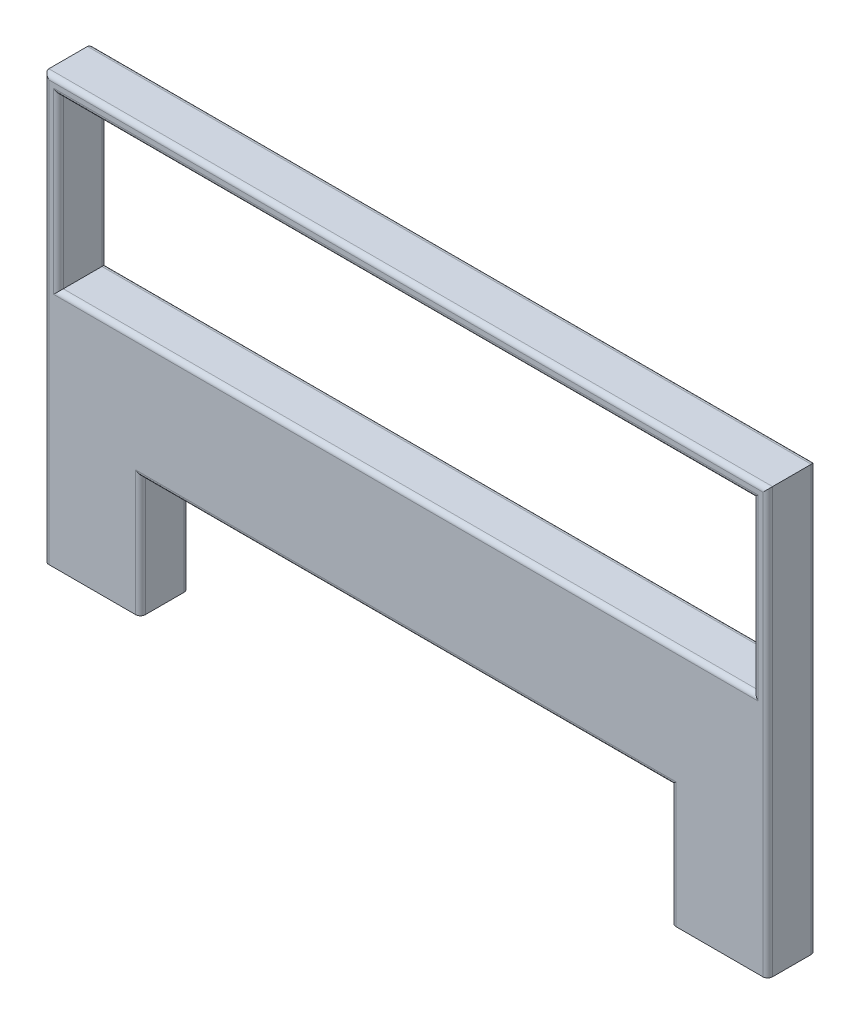
ISO-10303-21;
HEADER;
FILE_DESCRIPTION(('STEP AP214'),'2;1');
FILE_NAME('part.step','',(''),(''),'','','');
FILE_SCHEMA(('AUTOMOTIVE_DESIGN { 1 0 10303 214 1 1 1 1 }'));
ENDSEC;
DATA;
#1=APPLICATION_CONTEXT('core data for automotive mechanical design processes');
#2=APPLICATION_PROTOCOL_DEFINITION('international standard','automotive_design',2000,#1);
#3=PRODUCT_CONTEXT('',#1,'mechanical');
#4=PRODUCT('Part','Part','',(#3));
#5=PRODUCT_RELATED_PRODUCT_CATEGORY('part','',(#4));
#6=PRODUCT_DEFINITION_FORMATION('','',#4);
#7=PRODUCT_DEFINITION_CONTEXT('part definition',#1,'design');
#8=PRODUCT_DEFINITION('design','',#6,#7);
#9=PRODUCT_DEFINITION_SHAPE('','',#8);
#10=(LENGTH_UNIT() NAMED_UNIT(*) SI_UNIT(.MILLI.,.METRE.));
#11=(NAMED_UNIT(*) PLANE_ANGLE_UNIT() SI_UNIT($,.RADIAN.));
#12=(NAMED_UNIT(*) SI_UNIT($,.STERADIAN.) SOLID_ANGLE_UNIT());
#13=UNCERTAINTY_MEASURE_WITH_UNIT(LENGTH_MEASURE(1.E-05),#10,'distance_accuracy_value','');
#14=(GEOMETRIC_REPRESENTATION_CONTEXT(3) GLOBAL_UNCERTAINTY_ASSIGNED_CONTEXT((#13)) GLOBAL_UNIT_ASSIGNED_CONTEXT((#10,
#11,#12)) REPRESENTATION_CONTEXT('',''));
#15=CARTESIAN_POINT('',(0.,0.,0.));
#16=DIRECTION('',(0.,0.,1.));
#17=DIRECTION('',(1.,0.,0.));
#18=AXIS2_PLACEMENT_3D('',#15,#16,#17);
#19=CARTESIAN_POINT('',(0.,0.,100.));
#20=DIRECTION('',(0.,0.,-1.));
#21=DIRECTION('',(-1.,0.,0.));
#22=AXIS2_PLACEMENT_3D('',#19,#20,#21);
#23=PLANE('',#22);
#24=DIRECTION('',(0.,-1.,0.));
#25=VECTOR('',#24,1.);
#26=CARTESIAN_POINT('',(-850.336119727066,350.,100.));
#27=LINE('',#26,#25);
#28=CARTESIAN_POINT('',(-850.336119727066,-10.,100.));
#29=VERTEX_POINT('',#28);
#30=CARTESIAN_POINT('',(-850.336119727066,360.,100.));
#31=VERTEX_POINT('',#30);
#32=EDGE_CURVE('E381',#29,#31,#27,.F.);
#33=ORIENTED_EDGE('',*,*,#32,.T.);
#34=DIRECTION('',(-1.,0.,0.));
#35=VECTOR('',#34,1.);
#36=CARTESIAN_POINT('',(599.663880272934,360.,100.));
#37=LINE('',#36,#35);
#38=CARTESIAN_POINT('',(609.663880272934,360.,100.));
#39=VERTEX_POINT('',#38);
#40=EDGE_CURVE('E384',#31,#39,#37,.F.);
#41=ORIENTED_EDGE('',*,*,#40,.T.);
#42=DIRECTION('',(0.,1.,0.));
#43=VECTOR('',#42,1.);
#44=CARTESIAN_POINT('',(609.663880272934,0.,100.));
#45=LINE('',#44,#43);
#46=CARTESIAN_POINT('',(609.663880272934,-10.,100.));
#47=VERTEX_POINT('',#46);
#48=EDGE_CURVE('E378',#39,#47,#45,.F.);
#49=ORIENTED_EDGE('',*,*,#48,.T.);
#50=DIRECTION('',(1.,0.,0.));
#51=VECTOR('',#50,1.);
#52=CARTESIAN_POINT('',(-840.336119727066,-10.,100.));
#53=LINE('',#52,#51);
#54=EDGE_CURVE('E214',#47,#29,#53,.F.);
#55=ORIENTED_EDGE('',*,*,#54,.T.);
#56=EDGE_LOOP('',(#33,#41,#49,#55));
#57=FACE_BOUND('',#56,.T.);
#58=DIRECTION('',(1.,0.,0.));
#59=VECTOR('',#58,1.);
#60=CARTESIAN_POINT('',(0.,-240.,100.));
#61=LINE('',#60,#59);
#62=CARTESIAN_POINT('',(-680.336119727066,-240.,100.));
#63=VERTEX_POINT('',#62);
#64=CARTESIAN_POINT('',(439.663880272934,-240.,100.));
#65=VERTEX_POINT('',#64);
#66=EDGE_CURVE('E209',#63,#65,#61,.T.);
#67=ORIENTED_EDGE('',*,*,#66,.T.);
#68=DIRECTION('',(0.,-1.,0.));
#69=VECTOR('',#68,1.);
#70=CARTESIAN_POINT('',(439.663880272934,0.,100.));
#71=LINE('',#70,#69);
#72=CARTESIAN_POINT('',(439.663880272934,-500.,100.));
#73=VERTEX_POINT('',#72);
#74=EDGE_CURVE('E204',#65,#73,#71,.T.);
#75=ORIENTED_EDGE('',*,*,#74,.T.);
#76=DIRECTION('',(1.,0.,0.));
#77=VECTOR('',#76,1.);
#78=CARTESIAN_POINT('',(629.663880272934,-500.,100.));
#79=LINE('',#78,#77);
#80=CARTESIAN_POINT('',(619.663880272934,-500.,100.));
#81=VERTEX_POINT('',#80);
#82=EDGE_CURVE('E206',#73,#81,#79,.T.);
#83=ORIENTED_EDGE('',*,*,#82,.T.);
#84=DIRECTION('',(0.,1.,0.));
#85=VECTOR('',#84,1.);
#86=CARTESIAN_POINT('',(619.663880272934,0.,100.));
#87=LINE('',#86,#85);
#88=CARTESIAN_POINT('',(619.663880272934,370.,100.));
#89=VERTEX_POINT('',#88);
#90=EDGE_CURVE('E339',#81,#89,#87,.T.);
#91=ORIENTED_EDGE('',*,*,#90,.T.);
#92=DIRECTION('',(-1.,0.,0.));
#93=VECTOR('',#92,1.);
#94=CARTESIAN_POINT('',(0.,370.,100.));
#95=LINE('',#94,#93);
#96=CARTESIAN_POINT('',(-860.336119727066,370.,100.));
#97=VERTEX_POINT('',#96);
#98=EDGE_CURVE('E336',#89,#97,#95,.T.);
#99=ORIENTED_EDGE('',*,*,#98,.T.);
#100=DIRECTION('',(0.,-1.,0.));
#101=VECTOR('',#100,1.);
#102=CARTESIAN_POINT('',(-860.336119727066,-1.08541473754279E-13,100.));
#103=LINE('',#102,#101);
#104=CARTESIAN_POINT('',(-860.336119727066,-500.,100.));
#105=VERTEX_POINT('',#104);
#106=EDGE_CURVE('E367',#97,#105,#103,.T.);
#107=ORIENTED_EDGE('',*,*,#106,.T.);
#108=DIRECTION('',(1.,0.,0.));
#109=VECTOR('',#108,1.);
#110=CARTESIAN_POINT('',(-670.336119727066,-500.,100.));
#111=LINE('',#110,#109);
#112=CARTESIAN_POINT('',(-680.336119727066,-500.,100.));
#113=VERTEX_POINT('',#112);
#114=EDGE_CURVE('E225',#105,#113,#111,.T.);
#115=ORIENTED_EDGE('',*,*,#114,.T.);
#116=DIRECTION('',(0.,1.,0.));
#117=VECTOR('',#116,1.);
#118=CARTESIAN_POINT('',(-680.336119727066,0.,100.));
#119=LINE('',#118,#117);
#120=EDGE_CURVE('E371',#113,#63,#119,.T.);
#121=ORIENTED_EDGE('',*,*,#120,.T.);
#122=EDGE_LOOP('',(#67,#75,#83,#91,#99,#107,#115,#121));
#123=FACE_BOUND('',#122,.T.);
#124=ADVANCED_FACE('F39',(#57,#123),#23,.F.);
#125=CARTESIAN_POINT('',(0.,0.,0.));
#126=DIRECTION('',(0.,0.,-1.));
#127=DIRECTION('',(-1.,0.,0.));
#128=AXIS2_PLACEMENT_3D('',#125,#126,#127);
#129=PLANE('',#128);
#130=DIRECTION('',(0.,1.,0.));
#131=VECTOR('',#130,1.);
#132=CARTESIAN_POINT('',(609.663880272934,0.,0.));
#133=LINE('',#132,#131);
#134=CARTESIAN_POINT('',(609.663880272934,-10.,0.));
#135=VERTEX_POINT('',#134);
#136=CARTESIAN_POINT('',(609.663880272934,360.,0.));
#137=VERTEX_POINT('',#136);
#138=EDGE_CURVE('E424',#135,#137,#133,.T.);
#139=ORIENTED_EDGE('',*,*,#138,.T.);
#140=DIRECTION('',(-1.,0.,0.));
#141=VECTOR('',#140,1.);
#142=CARTESIAN_POINT('',(0.,360.,0.));
#143=LINE('',#142,#141);
#144=CARTESIAN_POINT('',(-850.336119727066,360.,0.));
#145=VERTEX_POINT('',#144);
#146=EDGE_CURVE('E430',#137,#145,#143,.T.);
#147=ORIENTED_EDGE('',*,*,#146,.T.);
#148=DIRECTION('',(0.,-1.,0.));
#149=VECTOR('',#148,1.);
#150=CARTESIAN_POINT('',(-850.336119727066,0.,0.));
#151=LINE('',#150,#149);
#152=CARTESIAN_POINT('',(-850.336119727066,-10.,0.));
#153=VERTEX_POINT('',#152);
#154=EDGE_CURVE('E427',#145,#153,#151,.T.);
#155=ORIENTED_EDGE('',*,*,#154,.T.);
#156=DIRECTION('',(1.,0.,0.));
#157=VECTOR('',#156,1.);
#158=CARTESIAN_POINT('',(0.,-10.,0.));
#159=LINE('',#158,#157);
#160=EDGE_CURVE('E421',#153,#135,#159,.T.);
#161=ORIENTED_EDGE('',*,*,#160,.T.);
#162=EDGE_LOOP('',(#139,#147,#155,#161));
#163=FACE_BOUND('',#162,.T.);
#164=DIRECTION('',(1.,0.,0.));
#165=VECTOR('',#164,1.);
#166=CARTESIAN_POINT('',(629.663880272934,-500.,0.));
#167=LINE('',#166,#165);
#168=CARTESIAN_POINT('',(439.663880272934,-500.,0.));
#169=VERTEX_POINT('',#168);
#170=CARTESIAN_POINT('',(619.663880272934,-500.,0.));
#171=VERTEX_POINT('',#170);
#172=EDGE_CURVE('E471',#169,#171,#167,.T.);
#173=ORIENTED_EDGE('',*,*,#172,.F.);
#174=DIRECTION('',(0.,-1.,0.));
#175=VECTOR('',#174,1.);
#176=CARTESIAN_POINT('',(439.663880272934,-250.,0.));
#177=LINE('',#176,#175);
#178=CARTESIAN_POINT('',(439.663880272934,-240.,0.));
#179=VERTEX_POINT('',#178);
#180=EDGE_CURVE('E418',#169,#179,#177,.F.);
#181=ORIENTED_EDGE('',*,*,#180,.T.);
#182=DIRECTION('',(1.,0.,0.));
#183=VECTOR('',#182,1.);
#184=CARTESIAN_POINT('',(-670.336119727066,-240.,0.));
#185=LINE('',#184,#183);
#186=CARTESIAN_POINT('',(-680.336119727066,-240.,0.));
#187=VERTEX_POINT('',#186);
#188=EDGE_CURVE('E415',#179,#187,#185,.F.);
#189=ORIENTED_EDGE('',*,*,#188,.T.);
#190=DIRECTION('',(0.,1.,0.));
#191=VECTOR('',#190,1.);
#192=CARTESIAN_POINT('',(-680.336119727066,-500.,0.));
#193=LINE('',#192,#191);
#194=CARTESIAN_POINT('',(-680.336119727066,-500.,0.));
#195=VERTEX_POINT('',#194);
#196=EDGE_CURVE('E412',#187,#195,#193,.F.);
#197=ORIENTED_EDGE('',*,*,#196,.T.);
#198=DIRECTION('',(1.,0.,0.));
#199=VECTOR('',#198,1.);
#200=CARTESIAN_POINT('',(-670.336119727066,-500.,0.));
#201=LINE('',#200,#199);
#202=CARTESIAN_POINT('',(-860.336119727066,-500.,0.));
#203=VERTEX_POINT('',#202);
#204=EDGE_CURVE('E226',#203,#195,#201,.T.);
#205=ORIENTED_EDGE('',*,*,#204,.F.);
#206=DIRECTION('',(0.,-1.,0.));
#207=VECTOR('',#206,1.);
#208=CARTESIAN_POINT('',(-860.336119727066,380.,0.));
#209=LINE('',#208,#207);
#210=CARTESIAN_POINT('',(-860.336119727066,370.,0.));
#211=VERTEX_POINT('',#210);
#212=EDGE_CURVE('E409',#203,#211,#209,.F.);
#213=ORIENTED_EDGE('',*,*,#212,.T.);
#214=DIRECTION('',(-1.,0.,0.));
#215=VECTOR('',#214,1.);
#216=CARTESIAN_POINT('',(629.663880272934,370.,0.));
#217=LINE('',#216,#215);
#218=CARTESIAN_POINT('',(619.663880272934,370.,0.));
#219=VERTEX_POINT('',#218);
#220=EDGE_CURVE('E406',#211,#219,#217,.F.);
#221=ORIENTED_EDGE('',*,*,#220,.T.);
#222=DIRECTION('',(0.,1.,0.));
#223=VECTOR('',#222,1.);
#224=CARTESIAN_POINT('',(619.663880272934,-500.,0.));
#225=LINE('',#224,#223);
#226=EDGE_CURVE('E403',#219,#171,#225,.F.);
#227=ORIENTED_EDGE('',*,*,#226,.T.);
#228=EDGE_LOOP('',(#173,#181,#189,#197,#205,#213,#221,#227));
#229=FACE_BOUND('',#228,.T.);
#230=ADVANCED_FACE('F469',(#163,#229),#129,.T.);
#231=CARTESIAN_POINT('',(-670.336119727066,-250.,100.));
#232=DIRECTION('',(-1.,0.,0.));
#233=DIRECTION('',(0.,0.,1.));
#234=AXIS2_PLACEMENT_3D('',#231,#232,#233);
#235=PLANE('',#234);
#236=DIRECTION('',(0.,0.,-1.));
#237=VECTOR('',#236,1.);
#238=CARTESIAN_POINT('',(-670.336119727066,-500.,100.));
#239=LINE('',#238,#237);
#240=CARTESIAN_POINT('',(-670.336119727066,-500.,90.));
#241=VERTEX_POINT('',#240);
#242=CARTESIAN_POINT('',(-670.336119727066,-500.,9.99999999999999));
#243=VERTEX_POINT('',#242);
#244=EDGE_CURVE('E495',#241,#243,#239,.T.);
#245=ORIENTED_EDGE('',*,*,#244,.T.);
#246=DIRECTION('',(0.,1.,0.));
#247=VECTOR('',#246,1.);
#248=CARTESIAN_POINT('',(-670.336119727066,-250.,9.99999999999999));
#249=LINE('',#248,#247);
#250=CARTESIAN_POINT('',(-670.336119727066,-250.,9.99999999999999));
#251=VERTEX_POINT('',#250);
#252=EDGE_CURVE('E244',#243,#251,#249,.T.);
#253=ORIENTED_EDGE('',*,*,#252,.T.);
#254=DIRECTION('',(0.,0.,-1.));
#255=VECTOR('',#254,1.);
#256=CARTESIAN_POINT('',(-670.336119727066,-250.,100.));
#257=LINE('',#256,#255);
#258=CARTESIAN_POINT('',(-670.336119727066,-250.,90.));
#259=VERTEX_POINT('',#258);
#260=EDGE_CURVE('E359',#259,#251,#257,.T.);
#261=ORIENTED_EDGE('',*,*,#260,.F.);
#262=DIRECTION('',(0.,1.,0.));
#263=VECTOR('',#262,1.);
#264=CARTESIAN_POINT('',(-670.336119727066,-250.,90.));
#265=LINE('',#264,#263);
#266=EDGE_CURVE('E237',#259,#241,#265,.F.);
#267=ORIENTED_EDGE('',*,*,#266,.T.);
#268=EDGE_LOOP('',(#245,#253,#261,#267));
#269=FACE_BOUND('',#268,.T.);
#270=ADVANCED_FACE('F535',(#269),#235,.F.);
#271=CARTESIAN_POINT('',(429.663880272934,-250.,100.));
#272=DIRECTION('',(0.,1.,0.));
#273=DIRECTION('',(-1.,0.,0.));
#274=AXIS2_PLACEMENT_3D('',#271,#272,#273);
#275=PLANE('',#274);
#276=DIRECTION('',(0.,0.,-1.));
#277=VECTOR('',#276,1.);
#278=CARTESIAN_POINT('',(429.663880272934,-250.,100.));
#279=LINE('',#278,#277);
#280=CARTESIAN_POINT('',(429.663880272934,-250.,90.));
#281=VERTEX_POINT('',#280);
#282=CARTESIAN_POINT('',(429.663880272934,-250.,9.99999999999999));
#283=VERTEX_POINT('',#282);
#284=EDGE_CURVE('E350',#281,#283,#279,.T.);
#285=ORIENTED_EDGE('',*,*,#284,.F.);
#286=DIRECTION('',(1.,0.,0.));
#287=VECTOR('',#286,1.);
#288=CARTESIAN_POINT('',(429.663880272934,-250.,90.));
#289=LINE('',#288,#287);
#290=EDGE_CURVE('E392',#281,#259,#289,.F.);
#291=ORIENTED_EDGE('',*,*,#290,.T.);
#292=ORIENTED_EDGE('',*,*,#260,.T.);
#293=DIRECTION('',(1.,0.,0.));
#294=VECTOR('',#293,1.);
#295=CARTESIAN_POINT('',(429.663880272934,-250.,9.99999999999999));
#296=LINE('',#295,#294);
#297=EDGE_CURVE('E388',#251,#283,#296,.T.);
#298=ORIENTED_EDGE('',*,*,#297,.T.);
#299=EDGE_LOOP('',(#285,#291,#292,#298));
#300=FACE_BOUND('',#299,.T.);
#301=ADVANCED_FACE('F555',(#300),#275,.F.);
#302=CARTESIAN_POINT('',(429.663880272934,-500.,100.));
#303=DIRECTION('',(1.,0.,0.));
#304=DIRECTION('',(0.,0.,-1.));
#305=AXIS2_PLACEMENT_3D('',#302,#303,#304);
#306=PLANE('',#305);
#307=ORIENTED_EDGE('',*,*,#284,.T.);
#308=DIRECTION('',(0.,-1.,0.));
#309=VECTOR('',#308,1.);
#310=CARTESIAN_POINT('',(429.663880272934,-500.,9.99999999999999));
#311=LINE('',#310,#309);
#312=CARTESIAN_POINT('',(429.663880272934,-500.,9.99999999999999));
#313=VERTEX_POINT('',#312);
#314=EDGE_CURVE('E454',#283,#313,#311,.T.);
#315=ORIENTED_EDGE('',*,*,#314,.T.);
#316=DIRECTION('',(0.,0.,-1.));
#317=VECTOR('',#316,1.);
#318=CARTESIAN_POINT('',(429.663880272934,-500.,100.));
#319=LINE('',#318,#317);
#320=CARTESIAN_POINT('',(429.663880272934,-500.,90.));
#321=VERTEX_POINT('',#320);
#322=EDGE_CURVE('E346',#321,#313,#319,.T.);
#323=ORIENTED_EDGE('',*,*,#322,.F.);
#324=DIRECTION('',(0.,-1.,0.));
#325=VECTOR('',#324,1.);
#326=CARTESIAN_POINT('',(429.663880272934,-500.,90.));
#327=LINE('',#326,#325);
#328=EDGE_CURVE('E230',#321,#281,#327,.F.);
#329=ORIENTED_EDGE('',*,*,#328,.T.);
#330=EDGE_LOOP('',(#307,#315,#323,#329));
#331=FACE_BOUND('',#330,.T.);
#332=ADVANCED_FACE('F459',(#331),#306,.F.);
#333=CARTESIAN_POINT('',(629.663880272934,-500.,100.));
#334=DIRECTION('',(0.,1.,0.));
#335=DIRECTION('',(-1.,0.,0.));
#336=AXIS2_PLACEMENT_3D('',#333,#334,#335);
#337=PLANE('',#336);
#338=ORIENTED_EDGE('',*,*,#322,.T.);
#339=CARTESIAN_POINT('',(439.663880272934,-500.,9.99999999999999));
#340=DIRECTION('',(0.,1.,0.));
#341=DIRECTION('',(-1.,0.,0.));
#342=AXIS2_PLACEMENT_3D('',#339,#340,#341);
#343=CIRCLE('',#342,10.);
#344=EDGE_CURVE('E232',#313,#169,#343,.F.);
#345=ORIENTED_EDGE('',*,*,#344,.T.);
#346=ORIENTED_EDGE('',*,*,#172,.T.);
#347=CARTESIAN_POINT('',(619.663880272934,-500.,9.99999999999999));
#348=DIRECTION('',(0.,1.,0.));
#349=DIRECTION('',(-1.,0.,0.));
#350=AXIS2_PLACEMENT_3D('',#347,#348,#349);
#351=CIRCLE('',#350,10.);
#352=CARTESIAN_POINT('',(629.663880272934,-500.,9.99999999999999));
#353=VERTEX_POINT('',#352);
#354=EDGE_CURVE('E233',#171,#353,#351,.F.);
#355=ORIENTED_EDGE('',*,*,#354,.T.);
#356=DIRECTION('',(0.,0.,-1.));
#357=VECTOR('',#356,1.);
#358=CARTESIAN_POINT('',(629.663880272934,-500.,100.));
#359=LINE('',#358,#357);
#360=CARTESIAN_POINT('',(629.663880272934,-500.,90.));
#361=VERTEX_POINT('',#360);
#362=EDGE_CURVE('E341',#361,#353,#359,.T.);
#363=ORIENTED_EDGE('',*,*,#362,.F.);
#364=CARTESIAN_POINT('',(619.663880272934,-500.,90.));
#365=DIRECTION('',(0.,1.,0.));
#366=DIRECTION('',(-1.,0.,0.));
#367=AXIS2_PLACEMENT_3D('',#364,#365,#366);
#368=CIRCLE('',#367,10.);
#369=EDGE_CURVE('E223',#361,#81,#368,.F.);
#370=ORIENTED_EDGE('',*,*,#369,.T.);
#371=ORIENTED_EDGE('',*,*,#82,.F.);
#372=CARTESIAN_POINT('',(439.663880272934,-500.,90.));
#373=DIRECTION('',(0.,1.,0.));
#374=DIRECTION('',(-1.,0.,0.));
#375=AXIS2_PLACEMENT_3D('',#372,#373,#374);
#376=CIRCLE('',#375,10.);
#377=EDGE_CURVE('E219',#73,#321,#376,.F.);
#378=ORIENTED_EDGE('',*,*,#377,.T.);
#379=EDGE_LOOP('',(#338,#345,#346,#355,#363,#370,#371,#378));
#380=FACE_BOUND('',#379,.T.);
#381=ADVANCED_FACE('F218',(#380),#337,.F.);
#382=CARTESIAN_POINT('',(629.663880272934,380.,100.));
#383=DIRECTION('',(-1.,0.,0.));
#384=DIRECTION('',(0.,-1.,0.));
#385=AXIS2_PLACEMENT_3D('',#382,#383,#384);
#386=PLANE('',#385);
#387=ORIENTED_EDGE('',*,*,#362,.T.);
#388=DIRECTION('',(0.,1.,0.));
#389=VECTOR('',#388,1.);
#390=CARTESIAN_POINT('',(629.663880272934,380.,9.99999999999999));
#391=LINE('',#390,#389);
#392=CARTESIAN_POINT('',(629.663880272934,380.,9.99999999999999));
#393=VERTEX_POINT('',#392);
#394=EDGE_CURVE('E11',#353,#393,#391,.T.);
#395=ORIENTED_EDGE('',*,*,#394,.T.);
#396=DIRECTION('',(0.,0.,-1.));
#397=VECTOR('',#396,1.);
#398=CARTESIAN_POINT('',(629.663880272934,380.,100.));
#399=LINE('',#398,#397);
#400=CARTESIAN_POINT('',(629.663880272934,380.,90.));
#401=VERTEX_POINT('',#400);
#402=EDGE_CURVE('E342',#401,#393,#399,.T.);
#403=ORIENTED_EDGE('',*,*,#402,.F.);
#404=DIRECTION('',(0.,1.,0.));
#405=VECTOR('',#404,1.);
#406=CARTESIAN_POINT('',(629.663880272934,380.,90.));
#407=LINE('',#406,#405);
#408=EDGE_CURVE('E49',#401,#361,#407,.F.);
#409=ORIENTED_EDGE('',*,*,#408,.T.);
#410=EDGE_LOOP('',(#387,#395,#403,#409));
#411=FACE_BOUND('',#410,.T.);
#412=ADVANCED_FACE('F340',(#411),#386,.F.);
#413=CARTESIAN_POINT('',(-870.336119727066,380.,100.));
#414=DIRECTION('',(0.,-1.,0.));
#415=DIRECTION('',(0.,0.,-1.));
#416=AXIS2_PLACEMENT_3D('',#413,#414,#415);
#417=PLANE('',#416);
#418=DIRECTION('',(0.,0.,-1.));
#419=VECTOR('',#418,1.);
#420=CARTESIAN_POINT('',(-870.336119727066,380.,100.));
#421=LINE('',#420,#419);
#422=CARTESIAN_POINT('',(-870.336119727066,380.,90.));
#423=VERTEX_POINT('',#422);
#424=CARTESIAN_POINT('',(-870.336119727066,380.,9.99999999999999));
#425=VERTEX_POINT('',#424);
#426=EDGE_CURVE('E352',#423,#425,#421,.T.);
#427=ORIENTED_EDGE('',*,*,#426,.F.);
#428=DIRECTION('',(-1.,0.,0.));
#429=VECTOR('',#428,1.);
#430=CARTESIAN_POINT('',(-870.336119727066,380.,90.));
#431=LINE('',#430,#429);
#432=EDGE_CURVE('E62',#423,#401,#431,.F.);
#433=ORIENTED_EDGE('',*,*,#432,.T.);
#434=ORIENTED_EDGE('',*,*,#402,.T.);
#435=DIRECTION('',(-1.,0.,0.));
#436=VECTOR('',#435,1.);
#437=CARTESIAN_POINT('',(-870.336119727066,380.,9.99999999999999));
#438=LINE('',#437,#436);
#439=EDGE_CURVE('E266',#393,#425,#438,.T.);
#440=ORIENTED_EDGE('',*,*,#439,.T.);
#441=EDGE_LOOP('',(#427,#433,#434,#440));
#442=FACE_BOUND('',#441,.T.);
#443=ADVANCED_FACE('F546',(#442),#417,.F.);
#444=CARTESIAN_POINT('',(-870.336119727066,380.,100.));
#445=DIRECTION('',(1.,0.,0.));
#446=DIRECTION('',(0.,1.,0.));
#447=AXIS2_PLACEMENT_3D('',#444,#445,#446);
#448=PLANE('',#447);
#449=ORIENTED_EDGE('',*,*,#426,.T.);
#450=DIRECTION('',(0.,-1.,0.));
#451=VECTOR('',#450,1.);
#452=CARTESIAN_POINT('',(-870.336119727066,-500.,9.99999999999999));
#453=LINE('',#452,#451);
#454=CARTESIAN_POINT('',(-870.336119727066,-500.,9.99999999999999));
#455=VERTEX_POINT('',#454);
#456=EDGE_CURVE('E262',#425,#455,#453,.T.);
#457=ORIENTED_EDGE('',*,*,#456,.T.);
#458=DIRECTION('',(0.,0.,-1.));
#459=VECTOR('',#458,1.);
#460=CARTESIAN_POINT('',(-870.336119727066,-500.,100.));
#461=LINE('',#460,#459);
#462=CARTESIAN_POINT('',(-870.336119727066,-500.,90.));
#463=VERTEX_POINT('',#462);
#464=EDGE_CURVE('E498',#463,#455,#461,.T.);
#465=ORIENTED_EDGE('',*,*,#464,.F.);
#466=DIRECTION('',(0.,-1.,0.));
#467=VECTOR('',#466,1.);
#468=CARTESIAN_POINT('',(-870.336119727066,380.,90.));
#469=LINE('',#468,#467);
#470=EDGE_CURVE('E259',#463,#423,#469,.F.);
#471=ORIENTED_EDGE('',*,*,#470,.T.);
#472=EDGE_LOOP('',(#449,#457,#465,#471));
#473=FACE_BOUND('',#472,.T.);
#474=ADVANCED_FACE('F504',(#473),#448,.F.);
#475=CARTESIAN_POINT('',(-670.336119727066,-500.,100.));
#476=DIRECTION('',(0.,1.,0.));
#477=DIRECTION('',(0.,0.,1.));
#478=AXIS2_PLACEMENT_3D('',#475,#476,#477);
#479=PLANE('',#478);
#480=ORIENTED_EDGE('',*,*,#204,.T.);
#481=CARTESIAN_POINT('',(-680.336119727066,-500.,9.99999999999999));
#482=DIRECTION('',(0.,1.,0.));
#483=DIRECTION('',(0.,0.,1.));
#484=AXIS2_PLACEMENT_3D('',#481,#482,#483);
#485=CIRCLE('',#484,10.);
#486=EDGE_CURVE('E256',#195,#243,#485,.F.);
#487=ORIENTED_EDGE('',*,*,#486,.T.);
#488=ORIENTED_EDGE('',*,*,#244,.F.);
#489=CARTESIAN_POINT('',(-680.336119727066,-500.,90.));
#490=DIRECTION('',(0.,1.,0.));
#491=DIRECTION('',(0.,0.,1.));
#492=AXIS2_PLACEMENT_3D('',#489,#490,#491);
#493=CIRCLE('',#492,10.);
#494=EDGE_CURVE('E253',#241,#113,#493,.F.);
#495=ORIENTED_EDGE('',*,*,#494,.T.);
#496=ORIENTED_EDGE('',*,*,#114,.F.);
#497=CARTESIAN_POINT('',(-860.336119727066,-500.,90.));
#498=DIRECTION('',(0.,1.,0.));
#499=DIRECTION('',(0.,0.,1.));
#500=AXIS2_PLACEMENT_3D('',#497,#498,#499);
#501=CIRCLE('',#500,10.);
#502=EDGE_CURVE('E247',#105,#463,#501,.F.);
#503=ORIENTED_EDGE('',*,*,#502,.T.);
#504=ORIENTED_EDGE('',*,*,#464,.T.);
#505=CARTESIAN_POINT('',(-860.336119727066,-500.,9.99999999999999));
#506=DIRECTION('',(0.,1.,0.));
#507=DIRECTION('',(0.,0.,1.));
#508=AXIS2_PLACEMENT_3D('',#505,#506,#507);
#509=CIRCLE('',#508,10.);
#510=EDGE_CURVE('E250',#455,#203,#509,.F.);
#511=ORIENTED_EDGE('',*,*,#510,.T.);
#512=EDGE_LOOP('',(#480,#487,#488,#495,#496,#503,#504,#511));
#513=FACE_BOUND('',#512,.T.);
#514=ADVANCED_FACE('F484',(#513),#479,.F.);
#515=CARTESIAN_POINT('',(-840.336119727066,350.,100.));
#516=DIRECTION('',(1.,0.,0.));
#517=DIRECTION('',(0.,0.,-1.));
#518=AXIS2_PLACEMENT_3D('',#515,#516,#517);
#519=PLANE('',#518);
#520=DIRECTION('',(0.,0.,-1.));
#521=VECTOR('',#520,1.);
#522=CARTESIAN_POINT('',(-840.336119727066,0.,100.));
#523=LINE('',#522,#521);
#524=CARTESIAN_POINT('',(-840.336119727066,0.,90.));
#525=VERTEX_POINT('',#524);
#526=CARTESIAN_POINT('',(-840.336119727066,0.,9.99999999999999));
#527=VERTEX_POINT('',#526);
#528=EDGE_CURVE('E491',#525,#527,#523,.T.);
#529=ORIENTED_EDGE('',*,*,#528,.T.);
#530=DIRECTION('',(0.,-1.,0.));
#531=VECTOR('',#530,1.);
#532=CARTESIAN_POINT('',(-840.336119727066,350.,9.99999999999999));
#533=LINE('',#532,#531);
#534=CARTESIAN_POINT('',(-840.336119727066,350.,9.99999999999999));
#535=VERTEX_POINT('',#534);
#536=EDGE_CURVE('E437',#527,#535,#533,.F.);
#537=ORIENTED_EDGE('',*,*,#536,.T.);
#538=DIRECTION('',(0.,0.,-1.));
#539=VECTOR('',#538,1.);
#540=CARTESIAN_POINT('',(-840.336119727066,350.,100.));
#541=LINE('',#540,#539);
#542=CARTESIAN_POINT('',(-840.336119727066,350.,90.));
#543=VERTEX_POINT('',#542);
#544=EDGE_CURVE('E281',#543,#535,#541,.T.);
#545=ORIENTED_EDGE('',*,*,#544,.F.);
#546=DIRECTION('',(0.,-1.,0.));
#547=VECTOR('',#546,1.);
#548=CARTESIAN_POINT('',(-840.336119727066,0.,90.));
#549=LINE('',#548,#547);
#550=EDGE_CURVE('E434',#543,#525,#549,.T.);
#551=ORIENTED_EDGE('',*,*,#550,.T.);
#552=EDGE_LOOP('',(#529,#537,#545,#551));
#553=FACE_BOUND('',#552,.T.);
#554=ADVANCED_FACE('F539',(#553),#519,.T.);
#555=CARTESIAN_POINT('',(-840.336119727066,0.,100.));
#556=DIRECTION('',(0.,1.,0.));
#557=DIRECTION('',(-1.,0.,0.));
#558=AXIS2_PLACEMENT_3D('',#555,#556,#557);
#559=PLANE('',#558);
#560=DIRECTION('',(0.,0.,-1.));
#561=VECTOR('',#560,1.);
#562=CARTESIAN_POINT('',(599.663880272934,0.,100.));
#563=LINE('',#562,#561);
#564=CARTESIAN_POINT('',(599.663880272934,0.,90.));
#565=VERTEX_POINT('',#564);
#566=CARTESIAN_POINT('',(599.663880272934,0.,9.99999999999999));
#567=VERTEX_POINT('',#566);
#568=EDGE_CURVE('E832',#565,#567,#563,.T.);
#569=ORIENTED_EDGE('',*,*,#568,.T.);
#570=DIRECTION('',(1.,0.,0.));
#571=VECTOR('',#570,1.);
#572=CARTESIAN_POINT('',(-840.336119727066,0.,9.99999999999999));
#573=LINE('',#572,#571);
#574=EDGE_CURVE('E449',#567,#527,#573,.F.);
#575=ORIENTED_EDGE('',*,*,#574,.T.);
#576=ORIENTED_EDGE('',*,*,#528,.F.);
#577=DIRECTION('',(1.,0.,0.));
#578=VECTOR('',#577,1.);
#579=CARTESIAN_POINT('',(599.663880272934,0.,90.));
#580=LINE('',#579,#578);
#581=EDGE_CURVE('E446',#525,#565,#580,.T.);
#582=ORIENTED_EDGE('',*,*,#581,.T.);
#583=EDGE_LOOP('',(#569,#575,#576,#582));
#584=FACE_BOUND('',#583,.T.);
#585=ADVANCED_FACE('F744',(#584),#559,.T.);
#586=CARTESIAN_POINT('',(599.663880272934,350.,100.));
#587=DIRECTION('',(-1.,0.,0.));
#588=DIRECTION('',(0.,0.,1.));
#589=AXIS2_PLACEMENT_3D('',#586,#587,#588);
#590=PLANE('',#589);
#591=DIRECTION('',(0.,0.,-1.));
#592=VECTOR('',#591,1.);
#593=CARTESIAN_POINT('',(599.663880272934,350.,100.));
#594=LINE('',#593,#592);
#595=CARTESIAN_POINT('',(599.663880272934,350.,90.));
#596=VERTEX_POINT('',#595);
#597=CARTESIAN_POINT('',(599.663880272934,350.,9.99999999999999));
#598=VERTEX_POINT('',#597);
#599=EDGE_CURVE('E845',#596,#598,#594,.T.);
#600=ORIENTED_EDGE('',*,*,#599,.T.);
#601=DIRECTION('',(0.,1.,0.));
#602=VECTOR('',#601,1.);
#603=CARTESIAN_POINT('',(599.663880272934,350.,9.99999999999999));
#604=LINE('',#603,#602);
#605=EDGE_CURVE('E443',#598,#567,#604,.F.);
#606=ORIENTED_EDGE('',*,*,#605,.T.);
#607=ORIENTED_EDGE('',*,*,#568,.F.);
#608=DIRECTION('',(0.,1.,0.));
#609=VECTOR('',#608,1.);
#610=CARTESIAN_POINT('',(599.663880272934,350.,90.));
#611=LINE('',#610,#609);
#612=EDGE_CURVE('E440',#565,#596,#611,.T.);
#613=ORIENTED_EDGE('',*,*,#612,.T.);
#614=EDGE_LOOP('',(#600,#606,#607,#613));
#615=FACE_BOUND('',#614,.T.);
#616=ADVANCED_FACE('F734',(#615),#590,.T.);
#617=CARTESIAN_POINT('',(-840.336119727066,350.,100.));
#618=DIRECTION('',(0.,-1.,0.));
#619=DIRECTION('',(0.,0.,-1.));
#620=AXIS2_PLACEMENT_3D('',#617,#618,#619);
#621=PLANE('',#620);
#622=ORIENTED_EDGE('',*,*,#599,.F.);
#623=DIRECTION('',(-1.,0.,0.));
#624=VECTOR('',#623,1.);
#625=CARTESIAN_POINT('',(-840.336119727066,350.,90.));
#626=LINE('',#625,#624);
#627=EDGE_CURVE('E399',#596,#543,#626,.T.);
#628=ORIENTED_EDGE('',*,*,#627,.T.);
#629=ORIENTED_EDGE('',*,*,#544,.T.);
#630=DIRECTION('',(-1.,0.,0.));
#631=VECTOR('',#630,1.);
#632=CARTESIAN_POINT('',(-840.336119727066,350.,9.99999999999999));
#633=LINE('',#632,#631);
#634=EDGE_CURVE('E395',#535,#598,#633,.F.);
#635=ORIENTED_EDGE('',*,*,#634,.T.);
#636=EDGE_LOOP('',(#622,#628,#629,#635));
#637=FACE_BOUND('',#636,.T.);
#638=ADVANCED_FACE('F572',(#637),#621,.T.);
#639=CARTESIAN_POINT('',(-680.336119727066,0.,90.));
#640=DIRECTION('',(0.,1.,0.));
#641=DIRECTION('',(0.,0.,1.));
#642=AXIS2_PLACEMENT_3D('',#639,#640,#641);
#643=CYLINDRICAL_SURFACE('',#642,10.);
#644=ORIENTED_EDGE('',*,*,#494,.F.);
#645=ORIENTED_EDGE('',*,*,#266,.F.);
#646=CARTESIAN_POINT('',(-680.336119727066,-240.,90.));
#647=DIRECTION('',(0.707106781186547,0.707106781186547,0.));
#648=DIRECTION('',(0.707106781186548,-0.707106781186547,0.));
#649=AXIS2_PLACEMENT_3D('',#646,#647,#648);
#650=ELLIPSE('',#649,14.1421356237309,10.);
#651=EDGE_CURVE('E276',#63,#259,#650,.T.);
#652=ORIENTED_EDGE('',*,*,#651,.F.);
#653=ORIENTED_EDGE('',*,*,#120,.F.);
#654=EDGE_LOOP('',(#644,#645,#652,#653));
#655=FACE_BOUND('',#654,.T.);
#656=ADVANCED_FACE('F569',(#655),#643,.T.);
#657=CARTESIAN_POINT('',(439.663880272934,0.,90.));
#658=DIRECTION('',(0.,-1.,0.));
#659=DIRECTION('',(0.,0.,-1.));
#660=AXIS2_PLACEMENT_3D('',#657,#658,#659);
#661=CYLINDRICAL_SURFACE('',#660,10.);
#662=ORIENTED_EDGE('',*,*,#377,.F.);
#663=ORIENTED_EDGE('',*,*,#74,.F.);
#664=CARTESIAN_POINT('',(439.663880272934,-240.,90.));
#665=DIRECTION('',(0.707106781186548,-0.707106781186547,0.));
#666=DIRECTION('',(0.707106781186547,0.707106781186547,0.));
#667=AXIS2_PLACEMENT_3D('',#664,#665,#666);
#668=ELLIPSE('',#667,14.142135623731,10.);
#669=EDGE_CURVE('E273',#281,#65,#668,.F.);
#670=ORIENTED_EDGE('',*,*,#669,.F.);
#671=ORIENTED_EDGE('',*,*,#328,.F.);
#672=EDGE_LOOP('',(#662,#663,#670,#671));
#673=FACE_BOUND('',#672,.T.);
#674=ADVANCED_FACE('F229',(#673),#661,.T.);
#675=CARTESIAN_POINT('',(0.,-240.,90.));
#676=DIRECTION('',(1.,0.,0.));
#677=DIRECTION('',(0.,1.,0.));
#678=AXIS2_PLACEMENT_3D('',#675,#676,#677);
#679=CYLINDRICAL_SURFACE('',#678,10.);
#680=ORIENTED_EDGE('',*,*,#651,.T.);
#681=ORIENTED_EDGE('',*,*,#290,.F.);
#682=ORIENTED_EDGE('',*,*,#669,.T.);
#683=ORIENTED_EDGE('',*,*,#66,.F.);
#684=EDGE_LOOP('',(#680,#681,#682,#683));
#685=FACE_BOUND('',#684,.T.);
#686=ADVANCED_FACE('F562',(#685),#679,.T.);
#687=CARTESIAN_POINT('',(-840.336119727066,-10.,90.));
#688=DIRECTION('',(-1.,0.,0.));
#689=DIRECTION('',(0.,-1.,0.));
#690=AXIS2_PLACEMENT_3D('',#687,#688,#689);
#691=CYLINDRICAL_SURFACE('',#690,10.);
#692=CARTESIAN_POINT('',(-850.336119727066,-10.,90.));
#693=DIRECTION('',(-0.707106781186547,0.707106781186547,0.));
#694=DIRECTION('',(0.707106781186547,0.707106781186547,0.));
#695=AXIS2_PLACEMENT_3D('',#692,#693,#694);
#696=ELLIPSE('',#695,14.1421356237309,10.);
#697=EDGE_CURVE('E289',#29,#525,#696,.T.);
#698=ORIENTED_EDGE('',*,*,#697,.F.);
#699=ORIENTED_EDGE('',*,*,#54,.F.);
#700=CARTESIAN_POINT('',(609.663880272934,-10.,90.));
#701=DIRECTION('',(-0.707106781186547,-0.707106781186547,0.));
#702=DIRECTION('',(0.707106781186547,-0.707106781186547,0.));
#703=AXIS2_PLACEMENT_3D('',#700,#701,#702);
#704=ELLIPSE('',#703,14.1421356237309,10.);
#705=EDGE_CURVE('E277',#565,#47,#704,.F.);
#706=ORIENTED_EDGE('',*,*,#705,.F.);
#707=ORIENTED_EDGE('',*,*,#581,.F.);
#708=EDGE_LOOP('',(#698,#699,#706,#707));
#709=FACE_BOUND('',#708,.T.);
#710=ADVANCED_FACE('F565',(#709),#691,.T.);
#711=CARTESIAN_POINT('',(609.663880272934,350.,90.));
#712=DIRECTION('',(0.,-1.,0.));
#713=DIRECTION('',(0.,0.,-1.));
#714=AXIS2_PLACEMENT_3D('',#711,#712,#713);
#715=CYLINDRICAL_SURFACE('',#714,10.);
#716=ORIENTED_EDGE('',*,*,#705,.T.);
#717=ORIENTED_EDGE('',*,*,#48,.F.);
#718=CARTESIAN_POINT('',(609.663880272934,360.,90.));
#719=DIRECTION('',(0.707106781186547,-0.707106781186547,0.));
#720=DIRECTION('',(0.707106781186547,0.707106781186547,0.));
#721=AXIS2_PLACEMENT_3D('',#718,#719,#720);
#722=ELLIPSE('',#721,14.1421356237309,10.);
#723=EDGE_CURVE('E285',#596,#39,#722,.F.);
#724=ORIENTED_EDGE('',*,*,#723,.F.);
#725=ORIENTED_EDGE('',*,*,#612,.F.);
#726=EDGE_LOOP('',(#716,#717,#724,#725));
#727=FACE_BOUND('',#726,.T.);
#728=ADVANCED_FACE('F581',(#727),#715,.T.);
#729=CARTESIAN_POINT('',(-850.336119727066,350.,90.));
#730=DIRECTION('',(0.,1.,0.));
#731=DIRECTION('',(0.,0.,1.));
#732=AXIS2_PLACEMENT_3D('',#729,#730,#731);
#733=CYLINDRICAL_SURFACE('',#732,10.);
#734=ORIENTED_EDGE('',*,*,#697,.T.);
#735=ORIENTED_EDGE('',*,*,#550,.F.);
#736=CARTESIAN_POINT('',(-850.336119727066,360.,90.));
#737=DIRECTION('',(0.707106781186547,0.707106781186547,0.));
#738=DIRECTION('',(0.707106781186547,-0.707106781186547,0.));
#739=AXIS2_PLACEMENT_3D('',#736,#737,#738);
#740=ELLIPSE('',#739,14.1421356237309,10.);
#741=EDGE_CURVE('E282',#31,#543,#740,.T.);
#742=ORIENTED_EDGE('',*,*,#741,.F.);
#743=ORIENTED_EDGE('',*,*,#32,.F.);
#744=EDGE_LOOP('',(#734,#735,#742,#743));
#745=FACE_BOUND('',#744,.T.);
#746=ADVANCED_FACE('F577',(#745),#733,.T.);
#747=CARTESIAN_POINT('',(-840.336119727066,360.,90.));
#748=DIRECTION('',(1.,0.,0.));
#749=DIRECTION('',(0.,0.,-1.));
#750=AXIS2_PLACEMENT_3D('',#747,#748,#749);
#751=CYLINDRICAL_SURFACE('',#750,10.);
#752=ORIENTED_EDGE('',*,*,#723,.T.);
#753=ORIENTED_EDGE('',*,*,#40,.F.);
#754=ORIENTED_EDGE('',*,*,#741,.T.);
#755=ORIENTED_EDGE('',*,*,#627,.F.);
#756=EDGE_LOOP('',(#752,#753,#754,#755));
#757=FACE_BOUND('',#756,.T.);
#758=ADVANCED_FACE('F574',(#757),#751,.T.);
#759=CARTESIAN_POINT('',(-680.336119727066,-250.,9.99999999999999));
#760=DIRECTION('',(0.,-1.,0.));
#761=DIRECTION('',(0.,0.,-1.));
#762=AXIS2_PLACEMENT_3D('',#759,#760,#761);
#763=CYLINDRICAL_SURFACE('',#762,10.);
#764=ORIENTED_EDGE('',*,*,#486,.F.);
#765=ORIENTED_EDGE('',*,*,#196,.F.);
#766=CARTESIAN_POINT('',(-680.336119727066,-240.,9.99999999999999));
#767=DIRECTION('',(-0.707106781186547,-0.707106781186547,0.));
#768=DIRECTION('',(-0.707106781186548,0.707106781186547,0.));
#769=AXIS2_PLACEMENT_3D('',#766,#767,#768);
#770=ELLIPSE('',#769,14.1421356237309,10.);
#771=EDGE_CURVE('E286',#251,#187,#770,.F.);
#772=ORIENTED_EDGE('',*,*,#771,.F.);
#773=ORIENTED_EDGE('',*,*,#252,.F.);
#774=EDGE_LOOP('',(#764,#765,#772,#773));
#775=FACE_BOUND('',#774,.T.);
#776=ADVANCED_FACE('F479',(#775),#763,.T.);
#777=CARTESIAN_POINT('',(439.663880272934,-500.,9.99999999999999));
#778=DIRECTION('',(0.,1.,0.));
#779=DIRECTION('',(0.,0.,1.));
#780=AXIS2_PLACEMENT_3D('',#777,#778,#779);
#781=CYLINDRICAL_SURFACE('',#780,10.);
#782=ORIENTED_EDGE('',*,*,#344,.F.);
#783=ORIENTED_EDGE('',*,*,#314,.F.);
#784=CARTESIAN_POINT('',(439.663880272934,-240.,9.99999999999999));
#785=DIRECTION('',(-0.707106781186548,0.707106781186547,0.));
#786=DIRECTION('',(-0.707106781186547,-0.707106781186547,0.));
#787=AXIS2_PLACEMENT_3D('',#784,#785,#786);
#788=ELLIPSE('',#787,14.142135623731,10.);
#789=EDGE_CURVE('E296',#179,#283,#788,.T.);
#790=ORIENTED_EDGE('',*,*,#789,.F.);
#791=ORIENTED_EDGE('',*,*,#180,.F.);
#792=EDGE_LOOP('',(#782,#783,#790,#791));
#793=FACE_BOUND('',#792,.T.);
#794=ADVANCED_FACE('F466',(#793),#781,.T.);
#795=CARTESIAN_POINT('',(429.663880272934,-240.,9.99999999999999));
#796=DIRECTION('',(-1.,0.,0.));
#797=DIRECTION('',(0.,-1.,0.));
#798=AXIS2_PLACEMENT_3D('',#795,#796,#797);
#799=CYLINDRICAL_SURFACE('',#798,10.);
#800=ORIENTED_EDGE('',*,*,#771,.T.);
#801=ORIENTED_EDGE('',*,*,#188,.F.);
#802=ORIENTED_EDGE('',*,*,#789,.T.);
#803=ORIENTED_EDGE('',*,*,#297,.F.);
#804=EDGE_LOOP('',(#800,#801,#802,#803));
#805=FACE_BOUND('',#804,.T.);
#806=ADVANCED_FACE('F473',(#805),#799,.T.);
#807=CARTESIAN_POINT('',(0.,-10.,10.));
#808=DIRECTION('',(1.,0.,0.));
#809=DIRECTION('',(0.,1.,0.));
#810=AXIS2_PLACEMENT_3D('',#807,#808,#809);
#811=CYLINDRICAL_SURFACE('',#810,10.);
#812=CARTESIAN_POINT('',(-850.336119727066,-10.,10.));
#813=DIRECTION('',(0.707106781186547,-0.707106781186547,0.));
#814=DIRECTION('',(-0.707106781186547,-0.707106781186547,0.));
#815=AXIS2_PLACEMENT_3D('',#812,#813,#814);
#816=ELLIPSE('',#815,14.1421356237309,10.);
#817=EDGE_CURVE('E310',#527,#153,#816,.F.);
#818=ORIENTED_EDGE('',*,*,#817,.F.);
#819=ORIENTED_EDGE('',*,*,#574,.F.);
#820=CARTESIAN_POINT('',(609.663880272934,-10.,10.));
#821=DIRECTION('',(0.707106781186547,0.707106781186547,0.));
#822=DIRECTION('',(-0.707106781186547,0.707106781186547,0.));
#823=AXIS2_PLACEMENT_3D('',#820,#821,#822);
#824=ELLIPSE('',#823,14.1421356237309,10.);
#825=EDGE_CURVE('E299',#135,#567,#824,.T.);
#826=ORIENTED_EDGE('',*,*,#825,.F.);
#827=ORIENTED_EDGE('',*,*,#160,.F.);
#828=EDGE_LOOP('',(#818,#819,#826,#827));
#829=FACE_BOUND('',#828,.T.);
#830=ADVANCED_FACE('F591',(#829),#811,.T.);
#831=CARTESIAN_POINT('',(609.663880272934,0.,10.));
#832=DIRECTION('',(0.,1.,0.));
#833=DIRECTION('',(0.,0.,1.));
#834=AXIS2_PLACEMENT_3D('',#831,#832,#833);
#835=CYLINDRICAL_SURFACE('',#834,10.);
#836=ORIENTED_EDGE('',*,*,#825,.T.);
#837=ORIENTED_EDGE('',*,*,#605,.F.);
#838=CARTESIAN_POINT('',(609.663880272934,360.,10.));
#839=DIRECTION('',(-0.707106781186547,0.707106781186547,0.));
#840=DIRECTION('',(-0.707106781186547,-0.707106781186547,0.));
#841=AXIS2_PLACEMENT_3D('',#838,#839,#840);
#842=ELLIPSE('',#841,14.1421356237309,10.);
#843=EDGE_CURVE('E306',#137,#598,#842,.T.);
#844=ORIENTED_EDGE('',*,*,#843,.F.);
#845=ORIENTED_EDGE('',*,*,#138,.F.);
#846=EDGE_LOOP('',(#836,#837,#844,#845));
#847=FACE_BOUND('',#846,.T.);
#848=ADVANCED_FACE('F598',(#847),#835,.T.);
#849=CARTESIAN_POINT('',(-850.336119727066,0.,10.));
#850=DIRECTION('',(0.,-1.,0.));
#851=DIRECTION('',(0.,0.,-1.));
#852=AXIS2_PLACEMENT_3D('',#849,#850,#851);
#853=CYLINDRICAL_SURFACE('',#852,10.);
#854=ORIENTED_EDGE('',*,*,#817,.T.);
#855=ORIENTED_EDGE('',*,*,#154,.F.);
#856=CARTESIAN_POINT('',(-850.336119727066,360.,10.));
#857=DIRECTION('',(-0.707106781186547,-0.707106781186547,0.));
#858=DIRECTION('',(-0.707106781186547,0.707106781186547,0.));
#859=AXIS2_PLACEMENT_3D('',#856,#857,#858);
#860=ELLIPSE('',#859,14.1421356237309,10.);
#861=EDGE_CURVE('E303',#535,#145,#860,.F.);
#862=ORIENTED_EDGE('',*,*,#861,.F.);
#863=ORIENTED_EDGE('',*,*,#536,.F.);
#864=EDGE_LOOP('',(#854,#855,#862,#863));
#865=FACE_BOUND('',#864,.T.);
#866=ADVANCED_FACE('F525',(#865),#853,.T.);
#867=CARTESIAN_POINT('',(0.,360.,10.));
#868=DIRECTION('',(-1.,0.,0.));
#869=DIRECTION('',(0.,0.,1.));
#870=AXIS2_PLACEMENT_3D('',#867,#868,#869);
#871=CYLINDRICAL_SURFACE('',#870,10.);
#872=ORIENTED_EDGE('',*,*,#843,.T.);
#873=ORIENTED_EDGE('',*,*,#634,.F.);
#874=ORIENTED_EDGE('',*,*,#861,.T.);
#875=ORIENTED_EDGE('',*,*,#146,.F.);
#876=EDGE_LOOP('',(#872,#873,#874,#875));
#877=FACE_BOUND('',#876,.T.);
#878=ADVANCED_FACE('F518',(#877),#871,.T.);
#879=CARTESIAN_POINT('',(619.663880272934,380.,9.99999999999999));
#880=DIRECTION('',(0.,-1.,0.));
#881=DIRECTION('',(1.,0.,0.));
#882=AXIS2_PLACEMENT_3D('',#879,#880,#881);
#883=CYLINDRICAL_SURFACE('',#882,10.);
#884=ORIENTED_EDGE('',*,*,#354,.F.);
#885=ORIENTED_EDGE('',*,*,#226,.F.);
#886=CARTESIAN_POINT('',(619.663880272934,370.,9.99999999999999));
#887=DIRECTION('',(0.707106781186548,-0.707106781186547,0.));
#888=DIRECTION('',(-0.707106781186547,-0.707106781186548,0.));
#889=AXIS2_PLACEMENT_3D('',#886,#887,#888);
#890=ELLIPSE('',#889,14.1421356237309,10.);
#891=EDGE_CURVE('E307',#393,#219,#890,.F.);
#892=ORIENTED_EDGE('',*,*,#891,.F.);
#893=ORIENTED_EDGE('',*,*,#394,.F.);
#894=EDGE_LOOP('',(#884,#885,#892,#893));
#895=FACE_BOUND('',#894,.T.);
#896=ADVANCED_FACE('F516',(#895),#883,.T.);
#897=CARTESIAN_POINT('',(-870.336119727066,370.,9.99999999999999));
#898=DIRECTION('',(1.,0.,0.));
#899=DIRECTION('',(0.,0.,-1.));
#900=AXIS2_PLACEMENT_3D('',#897,#898,#899);
#901=CYLINDRICAL_SURFACE('',#900,10.);
#902=ORIENTED_EDGE('',*,*,#891,.T.);
#903=ORIENTED_EDGE('',*,*,#220,.F.);
#904=CARTESIAN_POINT('',(-860.336119727066,370.,9.99999999999999));
#905=DIRECTION('',(0.707106781186547,0.707106781186548,0.));
#906=DIRECTION('',(0.707106781186548,-0.707106781186547,0.));
#907=AXIS2_PLACEMENT_3D('',#904,#905,#906);
#908=ELLIPSE('',#907,14.142135623731,10.);
#909=EDGE_CURVE('E317',#425,#211,#908,.F.);
#910=ORIENTED_EDGE('',*,*,#909,.F.);
#911=ORIENTED_EDGE('',*,*,#439,.F.);
#912=EDGE_LOOP('',(#902,#903,#910,#911));
#913=FACE_BOUND('',#912,.T.);
#914=ADVANCED_FACE('F510',(#913),#901,.T.);
#915=CARTESIAN_POINT('',(-860.336119727066,380.,9.99999999999999));
#916=DIRECTION('',(0.,1.,0.));
#917=DIRECTION('',(-1.,0.,0.));
#918=AXIS2_PLACEMENT_3D('',#915,#916,#917);
#919=CYLINDRICAL_SURFACE('',#918,10.);
#920=ORIENTED_EDGE('',*,*,#909,.T.);
#921=ORIENTED_EDGE('',*,*,#212,.F.);
#922=ORIENTED_EDGE('',*,*,#510,.F.);
#923=ORIENTED_EDGE('',*,*,#456,.F.);
#924=EDGE_LOOP('',(#920,#921,#922,#923));
#925=FACE_BOUND('',#924,.T.);
#926=ADVANCED_FACE('F512',(#925),#919,.T.);
#927=CARTESIAN_POINT('',(619.663880272934,0.,90.));
#928=DIRECTION('',(0.,1.,0.));
#929=DIRECTION('',(-1.,0.,0.));
#930=AXIS2_PLACEMENT_3D('',#927,#928,#929);
#931=CYLINDRICAL_SURFACE('',#930,10.);
#932=ORIENTED_EDGE('',*,*,#369,.F.);
#933=ORIENTED_EDGE('',*,*,#408,.F.);
#934=CARTESIAN_POINT('',(619.663880272934,370.,90.));
#935=DIRECTION('',(-0.707106781186548,0.707106781186547,0.));
#936=DIRECTION('',(0.707106781186547,0.707106781186548,0.));
#937=AXIS2_PLACEMENT_3D('',#934,#935,#936);
#938=ELLIPSE('',#937,14.1421356237309,10.);
#939=EDGE_CURVE('E43',#89,#401,#938,.T.);
#940=ORIENTED_EDGE('',*,*,#939,.F.);
#941=ORIENTED_EDGE('',*,*,#90,.F.);
#942=EDGE_LOOP('',(#932,#933,#940,#941));
#943=FACE_BOUND('',#942,.T.);
#944=ADVANCED_FACE('F41',(#943),#931,.T.);
#945=CARTESIAN_POINT('',(0.,370.,90.));
#946=DIRECTION('',(-1.,0.,0.));
#947=DIRECTION('',(0.,0.,1.));
#948=AXIS2_PLACEMENT_3D('',#945,#946,#947);
#949=CYLINDRICAL_SURFACE('',#948,10.);
#950=ORIENTED_EDGE('',*,*,#939,.T.);
#951=ORIENTED_EDGE('',*,*,#432,.F.);
#952=CARTESIAN_POINT('',(-860.336119727066,370.,90.));
#953=DIRECTION('',(-0.707106781186547,-0.707106781186548,0.));
#954=DIRECTION('',(-0.707106781186548,0.707106781186547,0.));
#955=AXIS2_PLACEMENT_3D('',#952,#953,#954);
#956=ELLIPSE('',#955,14.142135623731,10.);
#957=EDGE_CURVE('E323',#97,#423,#956,.T.);
#958=ORIENTED_EDGE('',*,*,#957,.F.);
#959=ORIENTED_EDGE('',*,*,#98,.F.);
#960=EDGE_LOOP('',(#950,#951,#958,#959));
#961=FACE_BOUND('',#960,.T.);
#962=ADVANCED_FACE('F335',(#961),#949,.T.);
#963=CARTESIAN_POINT('',(-860.336119727066,-1.08541473754279E-13,90.));
#964=DIRECTION('',(0.,-1.,0.));
#965=DIRECTION('',(1.,0.,0.));
#966=AXIS2_PLACEMENT_3D('',#963,#964,#965);
#967=CYLINDRICAL_SURFACE('',#966,10.);
#968=ORIENTED_EDGE('',*,*,#957,.T.);
#969=ORIENTED_EDGE('',*,*,#470,.F.);
#970=ORIENTED_EDGE('',*,*,#502,.F.);
#971=ORIENTED_EDGE('',*,*,#106,.F.);
#972=EDGE_LOOP('',(#968,#969,#970,#971));
#973=FACE_BOUND('',#972,.T.);
#974=ADVANCED_FACE('F613',(#973),#967,.T.);
#975=CLOSED_SHELL('',(#124,#230,#270,#301,#332,#381,#412,#443,#474,#514,#554,#585,#616,#638,
#656,#674,#686,#710,#728,#746,#758,#776,#794,#806,#830,#848,#866,#878,#896,#914,#926,#944,#962,#974));
#976=MANIFOLD_SOLID_BREP('B2',#975);
#977=ADVANCED_BREP_SHAPE_REPRESENTATION('',(#18,#976),#14);
#978=SHAPE_DEFINITION_REPRESENTATION(#9,#977);
ENDSEC;
END-ISO-10303-21;
